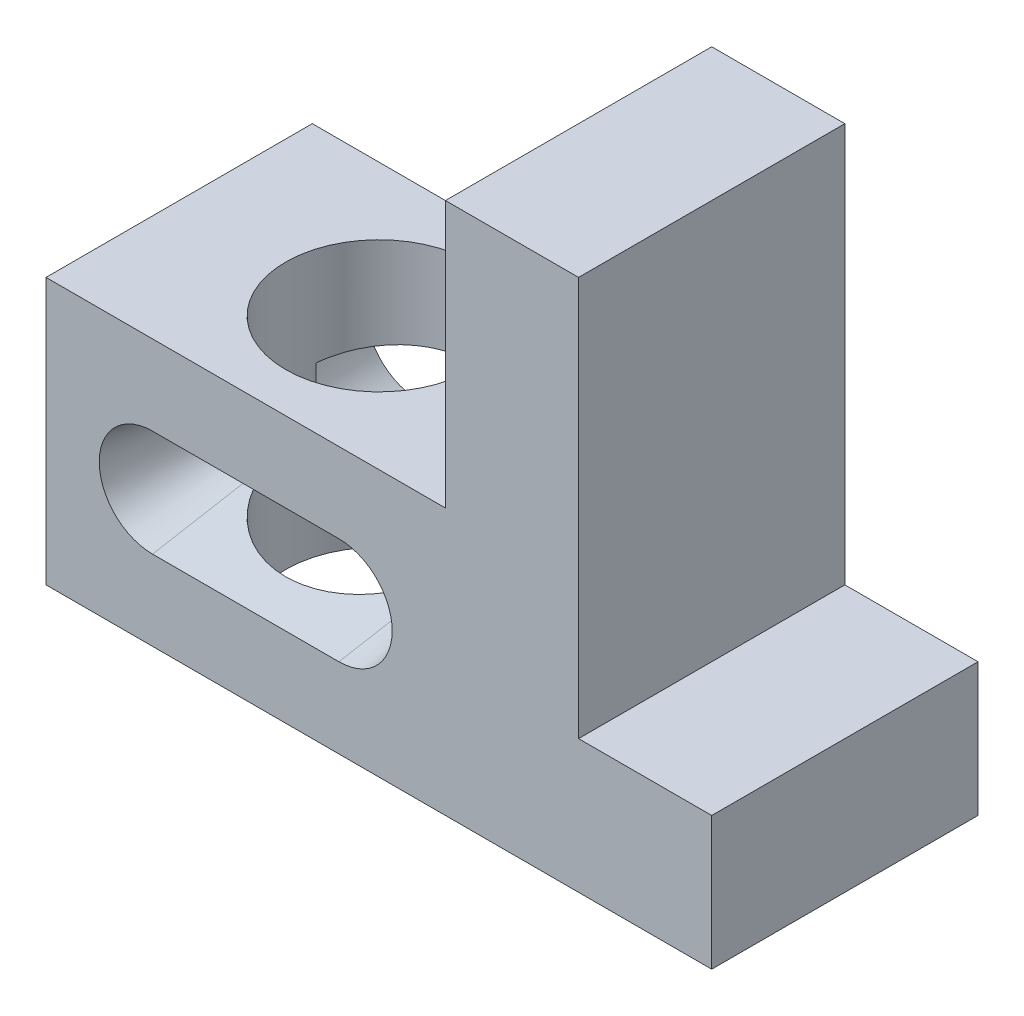
ISO-10303-21;
HEADER;
FILE_DESCRIPTION(('STEP AP214'),'2;1');
FILE_NAME('part.step','',(''),(''),'','','');
FILE_SCHEMA(('AUTOMOTIVE_DESIGN { 1 0 10303 214 1 1 1 1 }'));
ENDSEC;
DATA;
#1=APPLICATION_CONTEXT('core data for automotive mechanical design processes');
#2=APPLICATION_PROTOCOL_DEFINITION('international standard','automotive_design',2000,#1);
#3=PRODUCT_CONTEXT('',#1,'mechanical');
#4=PRODUCT('Part','Part','',(#3));
#5=PRODUCT_RELATED_PRODUCT_CATEGORY('part','',(#4));
#6=PRODUCT_DEFINITION_FORMATION('','',#4);
#7=PRODUCT_DEFINITION_CONTEXT('part definition',#1,'design');
#8=PRODUCT_DEFINITION('design','',#6,#7);
#9=PRODUCT_DEFINITION_SHAPE('','',#8);
#10=(LENGTH_UNIT() NAMED_UNIT(*) SI_UNIT(.MILLI.,.METRE.));
#11=(NAMED_UNIT(*) PLANE_ANGLE_UNIT() SI_UNIT($,.RADIAN.));
#12=(NAMED_UNIT(*) SI_UNIT($,.STERADIAN.) SOLID_ANGLE_UNIT());
#13=UNCERTAINTY_MEASURE_WITH_UNIT(LENGTH_MEASURE(1.E-05),#10,'distance_accuracy_value','');
#14=(GEOMETRIC_REPRESENTATION_CONTEXT(3) GLOBAL_UNCERTAINTY_ASSIGNED_CONTEXT((#13)) GLOBAL_UNIT_ASSIGNED_CONTEXT((#10,
#11,#12)) REPRESENTATION_CONTEXT('',''));
#15=CARTESIAN_POINT('',(0.,0.,0.));
#16=DIRECTION('',(0.,0.,1.));
#17=DIRECTION('',(1.,0.,0.));
#18=AXIS2_PLACEMENT_3D('',#15,#16,#17);
#19=CARTESIAN_POINT('',(20.,25.,30.));
#20=DIRECTION('',(0.,0.,1.));
#21=DIRECTION('',(1.,0.,0.));
#22=AXIS2_PLACEMENT_3D('',#19,#20,#21);
#23=PLANE('',#22);
#24=DIRECTION('',(0.,1.,0.));
#25=VECTOR('',#24,1.);
#26=CARTESIAN_POINT('',(54.2705098312484,0.,30.));
#27=LINE('',#26,#25);
#28=CARTESIAN_POINT('',(54.2705098312484,18.5265396141693,30.));
#29=VERTEX_POINT('',#28);
#30=CARTESIAN_POINT('',(54.2705098312484,31.4734603858307,30.));
#31=VERTEX_POINT('',#30);
#32=EDGE_CURVE('E379',#29,#31,#27,.T.);
#33=ORIENTED_EDGE('',*,*,#32,.F.);
#34=DIRECTION('',(1.,0.,0.));
#35=VECTOR('',#34,1.);
#36=CARTESIAN_POINT('',(20.,18.5265396141693,30.));
#37=LINE('',#36,#35);
#38=CARTESIAN_POINT('',(55.,18.5265396141693,30.));
#39=VERTEX_POINT('',#38);
#40=EDGE_CURVE('E219',#29,#39,#37,.T.);
#41=ORIENTED_EDGE('',*,*,#40,.T.);
#42=CARTESIAN_POINT('',(55.,25.,30.));
#43=DIRECTION('',(0.,0.,1.));
#44=DIRECTION('',(1.,0.,0.));
#45=AXIS2_PLACEMENT_3D('',#42,#43,#44);
#46=CIRCLE('',#45,6.4734603858307);
#47=CARTESIAN_POINT('',(55.,31.4734603858307,30.));
#48=VERTEX_POINT('',#47);
#49=EDGE_CURVE('E223',#39,#48,#46,.T.);
#50=ORIENTED_EDGE('',*,*,#49,.T.);
#51=DIRECTION('',(-1.,0.,0.));
#52=VECTOR('',#51,1.);
#53=CARTESIAN_POINT('',(20.,31.4734603858307,30.));
#54=LINE('',#53,#52);
#55=EDGE_CURVE('E214',#48,#31,#54,.T.);
#56=ORIENTED_EDGE('',*,*,#55,.T.);
#57=EDGE_LOOP('',(#33,#41,#50,#56));
#58=FACE_BOUND('',#57,.T.);
#59=ADVANCED_FACE('F30',(#58),#23,.T.);
#60=CARTESIAN_POINT('',(55.,25.,20.));
#61=DIRECTION('',(0.,0.,-1.));
#62=DIRECTION('',(-1.,0.,0.));
#63=AXIS2_PLACEMENT_3D('',#60,#61,#62);
#64=PLANE('',#63);
#65=DIRECTION('',(0.,1.,0.));
#66=VECTOR('',#65,1.);
#67=CARTESIAN_POINT('',(20.7294901687516,0.,20.));
#68=LINE('',#67,#66);
#69=CARTESIAN_POINT('',(20.7294901687516,18.5265396141693,20.));
#70=VERTEX_POINT('',#69);
#71=CARTESIAN_POINT('',(20.7294901687516,31.4734603858307,20.));
#72=VERTEX_POINT('',#71);
#73=EDGE_CURVE('E11',#70,#72,#68,.T.);
#74=ORIENTED_EDGE('',*,*,#73,.F.);
#75=DIRECTION('',(-1.,0.,0.));
#76=VECTOR('',#75,1.);
#77=CARTESIAN_POINT('',(55.,18.5265396141693,20.));
#78=LINE('',#77,#76);
#79=CARTESIAN_POINT('',(20.,18.5265396141693,20.));
#80=VERTEX_POINT('',#79);
#81=EDGE_CURVE('E180',#70,#80,#78,.T.);
#82=ORIENTED_EDGE('',*,*,#81,.T.);
#83=CARTESIAN_POINT('',(20.,25.,20.));
#84=DIRECTION('',(0.,0.,-1.));
#85=DIRECTION('',(-1.,0.,0.));
#86=AXIS2_PLACEMENT_3D('',#83,#84,#85);
#87=CIRCLE('',#86,6.47346038583069);
#88=CARTESIAN_POINT('',(20.,31.4734603858307,20.));
#89=VERTEX_POINT('',#88);
#90=EDGE_CURVE('E186',#80,#89,#87,.T.);
#91=ORIENTED_EDGE('',*,*,#90,.T.);
#92=DIRECTION('',(1.,0.,0.));
#93=VECTOR('',#92,1.);
#94=CARTESIAN_POINT('',(55.,31.4734603858307,20.));
#95=LINE('',#94,#93);
#96=EDGE_CURVE('E400',#89,#72,#95,.T.);
#97=ORIENTED_EDGE('',*,*,#96,.T.);
#98=EDGE_LOOP('',(#74,#82,#91,#97));
#99=FACE_BOUND('',#98,.T.);
#100=ADVANCED_FACE('F334',(#99),#64,.T.);
#101=CARTESIAN_POINT('',(125.,0.,50.));
#102=DIRECTION('',(0.,1.,0.));
#103=DIRECTION('',(-1.,0.,0.));
#104=AXIS2_PLACEMENT_3D('',#101,#102,#103);
#105=PLANE('',#104);
#106=CARTESIAN_POINT('',(37.5,0.,25.));
#107=DIRECTION('',(0.,1.,0.));
#108=DIRECTION('',(0.,0.,1.));
#109=AXIS2_PLACEMENT_3D('',#106,#107,#108);
#110=CIRCLE('',#109,17.5);
#111=CARTESIAN_POINT('',(37.5,0.,42.5));
#112=VERTEX_POINT('',#111);
#113=EDGE_CURVE('E181',#112,#112,#110,.T.);
#114=ORIENTED_EDGE('',*,*,#113,.T.);
#115=EDGE_LOOP('',(#114));
#116=FACE_BOUND('',#115,.T.);
#117=DIRECTION('',(1.,0.,0.));
#118=VECTOR('',#117,1.);
#119=CARTESIAN_POINT('',(125.,0.,0.));
#120=LINE('',#119,#118);
#121=CARTESIAN_POINT('',(0.,0.,0.));
#122=VERTEX_POINT('',#121);
#123=CARTESIAN_POINT('',(125.,0.,0.));
#124=VERTEX_POINT('',#123);
#125=EDGE_CURVE('E208',#122,#124,#120,.T.);
#126=ORIENTED_EDGE('',*,*,#125,.T.);
#127=DIRECTION('',(0.,0.,-1.));
#128=VECTOR('',#127,1.);
#129=CARTESIAN_POINT('',(125.,0.,50.));
#130=LINE('',#129,#128);
#131=CARTESIAN_POINT('',(125.,0.,50.));
#132=VERTEX_POINT('',#131);
#133=EDGE_CURVE('E171',#132,#124,#130,.T.);
#134=ORIENTED_EDGE('',*,*,#133,.F.);
#135=DIRECTION('',(1.,0.,0.));
#136=VECTOR('',#135,1.);
#137=CARTESIAN_POINT('',(125.,0.,50.));
#138=LINE('',#137,#136);
#139=CARTESIAN_POINT('',(0.,0.,50.));
#140=VERTEX_POINT('',#139);
#141=EDGE_CURVE('E229',#140,#132,#138,.T.);
#142=ORIENTED_EDGE('',*,*,#141,.F.);
#143=DIRECTION('',(0.,0.,-1.));
#144=VECTOR('',#143,1.);
#145=CARTESIAN_POINT('',(0.,0.,50.));
#146=LINE('',#145,#144);
#147=EDGE_CURVE('E247',#140,#122,#146,.T.);
#148=ORIENTED_EDGE('',*,*,#147,.T.);
#149=EDGE_LOOP('',(#126,#134,#142,#148));
#150=FACE_BOUND('',#149,.T.);
#151=ADVANCED_FACE('F32',(#116,#150),#105,.F.);
#152=CARTESIAN_POINT('',(125.,25.,50.));
#153=DIRECTION('',(-1.,0.,0.));
#154=DIRECTION('',(0.,-1.,0.));
#155=AXIS2_PLACEMENT_3D('',#152,#153,#154);
#156=PLANE('',#155);
#157=DIRECTION('',(0.,1.,0.));
#158=VECTOR('',#157,1.);
#159=CARTESIAN_POINT('',(125.,25.,0.));
#160=LINE('',#159,#158);
#161=CARTESIAN_POINT('',(125.,25.,0.));
#162=VERTEX_POINT('',#161);
#163=EDGE_CURVE('E250',#124,#162,#160,.T.);
#164=ORIENTED_EDGE('',*,*,#163,.T.);
#165=DIRECTION('',(0.,0.,-1.));
#166=VECTOR('',#165,1.);
#167=CARTESIAN_POINT('',(125.,25.,50.));
#168=LINE('',#167,#166);
#169=CARTESIAN_POINT('',(125.,25.,50.));
#170=VERTEX_POINT('',#169);
#171=EDGE_CURVE('E280',#170,#162,#168,.T.);
#172=ORIENTED_EDGE('',*,*,#171,.F.);
#173=DIRECTION('',(0.,1.,0.));
#174=VECTOR('',#173,1.);
#175=CARTESIAN_POINT('',(125.,25.,50.));
#176=LINE('',#175,#174);
#177=EDGE_CURVE('E232',#132,#170,#176,.T.);
#178=ORIENTED_EDGE('',*,*,#177,.F.);
#179=ORIENTED_EDGE('',*,*,#133,.T.);
#180=EDGE_LOOP('',(#164,#172,#178,#179));
#181=FACE_BOUND('',#180,.T.);
#182=ADVANCED_FACE('F286',(#181),#156,.F.);
#183=CARTESIAN_POINT('',(100.,25.,50.));
#184=DIRECTION('',(0.,-1.,0.));
#185=DIRECTION('',(1.,0.,0.));
#186=AXIS2_PLACEMENT_3D('',#183,#184,#185);
#187=PLANE('',#186);
#188=DIRECTION('',(-1.,0.,0.));
#189=VECTOR('',#188,1.);
#190=CARTESIAN_POINT('',(100.,25.,0.));
#191=LINE('',#190,#189);
#192=CARTESIAN_POINT('',(100.,25.,0.));
#193=VERTEX_POINT('',#192);
#194=EDGE_CURVE('E252',#162,#193,#191,.T.);
#195=ORIENTED_EDGE('',*,*,#194,.T.);
#196=DIRECTION('',(0.,0.,-1.));
#197=VECTOR('',#196,1.);
#198=CARTESIAN_POINT('',(100.,25.,50.));
#199=LINE('',#198,#197);
#200=CARTESIAN_POINT('',(100.,25.,50.));
#201=VERTEX_POINT('',#200);
#202=EDGE_CURVE('E277',#201,#193,#199,.T.);
#203=ORIENTED_EDGE('',*,*,#202,.F.);
#204=DIRECTION('',(-1.,0.,0.));
#205=VECTOR('',#204,1.);
#206=CARTESIAN_POINT('',(100.,25.,50.));
#207=LINE('',#206,#205);
#208=EDGE_CURVE('E235',#170,#201,#207,.T.);
#209=ORIENTED_EDGE('',*,*,#208,.F.);
#210=ORIENTED_EDGE('',*,*,#171,.T.);
#211=EDGE_LOOP('',(#195,#203,#209,#210));
#212=FACE_BOUND('',#211,.T.);
#213=ADVANCED_FACE('F301',(#212),#187,.F.);
#214=CARTESIAN_POINT('',(100.,100.,50.));
#215=DIRECTION('',(-1.,0.,0.));
#216=DIRECTION('',(0.,-1.,0.));
#217=AXIS2_PLACEMENT_3D('',#214,#215,#216);
#218=PLANE('',#217);
#219=DIRECTION('',(0.,1.,0.));
#220=VECTOR('',#219,1.);
#221=CARTESIAN_POINT('',(100.,100.,0.));
#222=LINE('',#221,#220);
#223=CARTESIAN_POINT('',(100.,100.,0.));
#224=VERTEX_POINT('',#223);
#225=EDGE_CURVE('E254',#193,#224,#222,.T.);
#226=ORIENTED_EDGE('',*,*,#225,.T.);
#227=DIRECTION('',(0.,0.,-1.));
#228=VECTOR('',#227,1.);
#229=CARTESIAN_POINT('',(100.,100.,50.));
#230=LINE('',#229,#228);
#231=CARTESIAN_POINT('',(100.,100.,50.));
#232=VERTEX_POINT('',#231);
#233=EDGE_CURVE('E274',#232,#224,#230,.T.);
#234=ORIENTED_EDGE('',*,*,#233,.F.);
#235=DIRECTION('',(0.,1.,0.));
#236=VECTOR('',#235,1.);
#237=CARTESIAN_POINT('',(100.,100.,50.));
#238=LINE('',#237,#236);
#239=EDGE_CURVE('E237',#201,#232,#238,.T.);
#240=ORIENTED_EDGE('',*,*,#239,.F.);
#241=ORIENTED_EDGE('',*,*,#202,.T.);
#242=EDGE_LOOP('',(#226,#234,#240,#241));
#243=FACE_BOUND('',#242,.T.);
#244=ADVANCED_FACE('F305',(#243),#218,.F.);
#245=CARTESIAN_POINT('',(75.,100.,50.));
#246=DIRECTION('',(0.,-1.,0.));
#247=DIRECTION('',(0.,0.,-1.));
#248=AXIS2_PLACEMENT_3D('',#245,#246,#247);
#249=PLANE('',#248);
#250=DIRECTION('',(-1.,0.,0.));
#251=VECTOR('',#250,1.);
#252=CARTESIAN_POINT('',(75.,100.,0.));
#253=LINE('',#252,#251);
#254=CARTESIAN_POINT('',(75.,100.,0.));
#255=VERTEX_POINT('',#254);
#256=EDGE_CURVE('E256',#224,#255,#253,.T.);
#257=ORIENTED_EDGE('',*,*,#256,.T.);
#258=DIRECTION('',(0.,0.,-1.));
#259=VECTOR('',#258,1.);
#260=CARTESIAN_POINT('',(75.,100.,50.));
#261=LINE('',#260,#259);
#262=CARTESIAN_POINT('',(75.,100.,50.));
#263=VERTEX_POINT('',#262);
#264=EDGE_CURVE('E271',#263,#255,#261,.T.);
#265=ORIENTED_EDGE('',*,*,#264,.F.);
#266=DIRECTION('',(-1.,0.,0.));
#267=VECTOR('',#266,1.);
#268=CARTESIAN_POINT('',(75.,100.,50.));
#269=LINE('',#268,#267);
#270=EDGE_CURVE('E239',#232,#263,#269,.T.);
#271=ORIENTED_EDGE('',*,*,#270,.F.);
#272=ORIENTED_EDGE('',*,*,#233,.T.);
#273=EDGE_LOOP('',(#257,#265,#271,#272));
#274=FACE_BOUND('',#273,.T.);
#275=ADVANCED_FACE('F324',(#274),#249,.F.);
#276=CARTESIAN_POINT('',(75.,50.,50.));
#277=DIRECTION('',(1.,0.,0.));
#278=DIRECTION('',(0.,0.,-1.));
#279=AXIS2_PLACEMENT_3D('',#276,#277,#278);
#280=PLANE('',#279);
#281=DIRECTION('',(0.,-1.,0.));
#282=VECTOR('',#281,1.);
#283=CARTESIAN_POINT('',(75.,50.,0.));
#284=LINE('',#283,#282);
#285=CARTESIAN_POINT('',(75.,50.,0.));
#286=VERTEX_POINT('',#285);
#287=EDGE_CURVE('E258',#255,#286,#284,.T.);
#288=ORIENTED_EDGE('',*,*,#287,.T.);
#289=DIRECTION('',(0.,0.,-1.));
#290=VECTOR('',#289,1.);
#291=CARTESIAN_POINT('',(75.,50.,50.));
#292=LINE('',#291,#290);
#293=CARTESIAN_POINT('',(75.,50.,50.));
#294=VERTEX_POINT('',#293);
#295=EDGE_CURVE('E268',#294,#286,#292,.T.);
#296=ORIENTED_EDGE('',*,*,#295,.F.);
#297=DIRECTION('',(0.,-1.,0.));
#298=VECTOR('',#297,1.);
#299=CARTESIAN_POINT('',(75.,50.,50.));
#300=LINE('',#299,#298);
#301=EDGE_CURVE('E241',#263,#294,#300,.T.);
#302=ORIENTED_EDGE('',*,*,#301,.F.);
#303=ORIENTED_EDGE('',*,*,#264,.T.);
#304=EDGE_LOOP('',(#288,#296,#302,#303));
#305=FACE_BOUND('',#304,.T.);
#306=ADVANCED_FACE('F321',(#305),#280,.F.);
#307=CARTESIAN_POINT('',(0.,50.,50.));
#308=DIRECTION('',(0.,-1.,0.));
#309=DIRECTION('',(0.,0.,-1.));
#310=AXIS2_PLACEMENT_3D('',#307,#308,#309);
#311=PLANE('',#310);
#312=CARTESIAN_POINT('',(37.5,50.,25.));
#313=DIRECTION('',(0.,1.,0.));
#314=DIRECTION('',(0.,0.,1.));
#315=AXIS2_PLACEMENT_3D('',#312,#313,#314);
#316=CIRCLE('',#315,17.5);
#317=CARTESIAN_POINT('',(37.5,50.,42.5));
#318=VERTEX_POINT('',#317);
#319=EDGE_CURVE('E416',#318,#318,#316,.T.);
#320=ORIENTED_EDGE('',*,*,#319,.F.);
#321=EDGE_LOOP('',(#320));
#322=FACE_BOUND('',#321,.T.);
#323=DIRECTION('',(-1.,0.,0.));
#324=VECTOR('',#323,1.);
#325=CARTESIAN_POINT('',(0.,50.,0.));
#326=LINE('',#325,#324);
#327=CARTESIAN_POINT('',(0.,50.,0.));
#328=VERTEX_POINT('',#327);
#329=EDGE_CURVE('E260',#286,#328,#326,.T.);
#330=ORIENTED_EDGE('',*,*,#329,.T.);
#331=DIRECTION('',(0.,0.,-1.));
#332=VECTOR('',#331,1.);
#333=CARTESIAN_POINT('',(0.,50.,50.));
#334=LINE('',#333,#332);
#335=CARTESIAN_POINT('',(0.,50.,50.));
#336=VERTEX_POINT('',#335);
#337=EDGE_CURVE('E265',#336,#328,#334,.T.);
#338=ORIENTED_EDGE('',*,*,#337,.F.);
#339=DIRECTION('',(-1.,0.,0.));
#340=VECTOR('',#339,1.);
#341=CARTESIAN_POINT('',(0.,50.,50.));
#342=LINE('',#341,#340);
#343=EDGE_CURVE('E243',#294,#336,#342,.T.);
#344=ORIENTED_EDGE('',*,*,#343,.F.);
#345=ORIENTED_EDGE('',*,*,#295,.T.);
#346=EDGE_LOOP('',(#330,#338,#344,#345));
#347=FACE_BOUND('',#346,.T.);
#348=ADVANCED_FACE('F317',(#322,#347),#311,.F.);
#349=CARTESIAN_POINT('',(0.,0.,50.));
#350=DIRECTION('',(1.,0.,0.));
#351=DIRECTION('',(0.,0.,-1.));
#352=AXIS2_PLACEMENT_3D('',#349,#350,#351);
#353=PLANE('',#352);
#354=DIRECTION('',(0.,-1.,0.));
#355=VECTOR('',#354,1.);
#356=CARTESIAN_POINT('',(0.,0.,0.));
#357=LINE('',#356,#355);
#358=EDGE_CURVE('E233',#328,#122,#357,.T.);
#359=ORIENTED_EDGE('',*,*,#358,.T.);
#360=ORIENTED_EDGE('',*,*,#147,.F.);
#361=DIRECTION('',(0.,-1.,0.));
#362=VECTOR('',#361,1.);
#363=CARTESIAN_POINT('',(0.,0.,50.));
#364=LINE('',#363,#362);
#365=EDGE_CURVE('E245',#336,#140,#364,.T.);
#366=ORIENTED_EDGE('',*,*,#365,.F.);
#367=ORIENTED_EDGE('',*,*,#337,.T.);
#368=EDGE_LOOP('',(#359,#360,#366,#367));
#369=FACE_BOUND('',#368,.T.);
#370=ADVANCED_FACE('F315',(#369),#353,.F.);
#371=CARTESIAN_POINT('',(0.,0.,50.));
#372=DIRECTION('',(0.,0.,-1.));
#373=DIRECTION('',(-1.,0.,0.));
#374=AXIS2_PLACEMENT_3D('',#371,#372,#373);
#375=PLANE('',#374);
#376=DIRECTION('',(1.,0.,0.));
#377=VECTOR('',#376,1.);
#378=CARTESIAN_POINT('',(20.,15.,50.));
#379=LINE('',#378,#377);
#380=CARTESIAN_POINT('',(20.,15.,50.));
#381=VERTEX_POINT('',#380);
#382=CARTESIAN_POINT('',(55.,15.,50.));
#383=VERTEX_POINT('',#382);
#384=EDGE_CURVE('E195',#381,#383,#379,.T.);
#385=ORIENTED_EDGE('',*,*,#384,.F.);
#386=CARTESIAN_POINT('',(20.,25.,50.));
#387=DIRECTION('',(0.,0.,1.));
#388=DIRECTION('',(1.,0.,0.));
#389=AXIS2_PLACEMENT_3D('',#386,#387,#388);
#390=CIRCLE('',#389,10.);
#391=CARTESIAN_POINT('',(20.,35.,50.));
#392=VERTEX_POINT('',#391);
#393=EDGE_CURVE('E193',#392,#381,#390,.T.);
#394=ORIENTED_EDGE('',*,*,#393,.F.);
#395=DIRECTION('',(-1.,0.,0.));
#396=VECTOR('',#395,1.);
#397=CARTESIAN_POINT('',(20.,35.,50.));
#398=LINE('',#397,#396);
#399=CARTESIAN_POINT('',(55.,35.,50.));
#400=VERTEX_POINT('',#399);
#401=EDGE_CURVE('E202',#400,#392,#398,.T.);
#402=ORIENTED_EDGE('',*,*,#401,.F.);
#403=CARTESIAN_POINT('',(55.,25.,50.));
#404=DIRECTION('',(0.,0.,1.));
#405=DIRECTION('',(1.,0.,0.));
#406=AXIS2_PLACEMENT_3D('',#403,#404,#405);
#407=CIRCLE('',#406,10.);
#408=EDGE_CURVE('E199',#383,#400,#407,.T.);
#409=ORIENTED_EDGE('',*,*,#408,.F.);
#410=EDGE_LOOP('',(#385,#394,#402,#409));
#411=FACE_BOUND('',#410,.T.);
#412=ORIENTED_EDGE('',*,*,#141,.T.);
#413=ORIENTED_EDGE('',*,*,#177,.T.);
#414=ORIENTED_EDGE('',*,*,#208,.T.);
#415=ORIENTED_EDGE('',*,*,#239,.T.);
#416=ORIENTED_EDGE('',*,*,#270,.T.);
#417=ORIENTED_EDGE('',*,*,#301,.T.);
#418=ORIENTED_EDGE('',*,*,#343,.T.);
#419=ORIENTED_EDGE('',*,*,#365,.T.);
#420=EDGE_LOOP('',(#412,#413,#414,#415,#416,#417,#418,#419));
#421=FACE_BOUND('',#420,.T.);
#422=ADVANCED_FACE('F309',(#411,#421),#375,.F.);
#423=CARTESIAN_POINT('',(0.,0.,0.));
#424=DIRECTION('',(0.,0.,-1.));
#425=DIRECTION('',(-1.,0.,0.));
#426=AXIS2_PLACEMENT_3D('',#423,#424,#425);
#427=PLANE('',#426);
#428=CARTESIAN_POINT('',(55.,25.,0.));
#429=DIRECTION('',(0.,0.,-1.));
#430=DIRECTION('',(-1.,0.,0.));
#431=AXIS2_PLACEMENT_3D('',#428,#429,#430);
#432=CIRCLE('',#431,10.);
#433=CARTESIAN_POINT('',(55.,35.,0.));
#434=VERTEX_POINT('',#433);
#435=CARTESIAN_POINT('',(55.,15.,0.));
#436=VERTEX_POINT('',#435);
#437=EDGE_CURVE('E384',#434,#436,#432,.T.);
#438=ORIENTED_EDGE('',*,*,#437,.F.);
#439=DIRECTION('',(1.,0.,0.));
#440=VECTOR('',#439,1.);
#441=CARTESIAN_POINT('',(55.,35.,0.));
#442=LINE('',#441,#440);
#443=CARTESIAN_POINT('',(20.,35.,0.));
#444=VERTEX_POINT('',#443);
#445=EDGE_CURVE('E392',#444,#434,#442,.T.);
#446=ORIENTED_EDGE('',*,*,#445,.F.);
#447=CARTESIAN_POINT('',(20.,25.,0.));
#448=DIRECTION('',(0.,0.,-1.));
#449=DIRECTION('',(-1.,0.,0.));
#450=AXIS2_PLACEMENT_3D('',#447,#448,#449);
#451=CIRCLE('',#450,10.);
#452=CARTESIAN_POINT('',(20.,15.,0.));
#453=VERTEX_POINT('',#452);
#454=EDGE_CURVE('E389',#453,#444,#451,.T.);
#455=ORIENTED_EDGE('',*,*,#454,.F.);
#456=DIRECTION('',(-1.,0.,0.));
#457=VECTOR('',#456,1.);
#458=CARTESIAN_POINT('',(20.,15.,0.));
#459=LINE('',#458,#457);
#460=EDGE_CURVE('E386',#436,#453,#459,.T.);
#461=ORIENTED_EDGE('',*,*,#460,.F.);
#462=EDGE_LOOP('',(#438,#446,#455,#461));
#463=FACE_BOUND('',#462,.T.);
#464=ORIENTED_EDGE('',*,*,#125,.F.);
#465=ORIENTED_EDGE('',*,*,#358,.F.);
#466=ORIENTED_EDGE('',*,*,#329,.F.);
#467=ORIENTED_EDGE('',*,*,#287,.F.);
#468=ORIENTED_EDGE('',*,*,#256,.F.);
#469=ORIENTED_EDGE('',*,*,#225,.F.);
#470=ORIENTED_EDGE('',*,*,#194,.F.);
#471=ORIENTED_EDGE('',*,*,#163,.F.);
#472=EDGE_LOOP('',(#464,#465,#466,#467,#468,#469,#470,#471));
#473=FACE_BOUND('',#472,.T.);
#474=ADVANCED_FACE('F294',(#463,#473),#427,.T.);
#475=CARTESIAN_POINT('',(20.,25.,50.));
#476=DIRECTION('',(0.,0.,1.));
#477=DIRECTION('',(1.,0.,0.));
#478=AXIS2_PLACEMENT_3D('',#475,#476,#477);
#479=CONICAL_SURFACE('',#478,10.,0.174532925199433);
#480=ORIENTED_EDGE('',*,*,#393,.T.);
#481=DIRECTION('',(0.,-0.173648177666931,0.984807753012208));
#482=VECTOR('',#481,1.);
#483=CARTESIAN_POINT('',(20.,15.,50.));
#484=LINE('',#483,#482);
#485=CARTESIAN_POINT('',(20.,18.5265396141693,30.));
#486=VERTEX_POINT('',#485);
#487=EDGE_CURVE('E210',#486,#381,#484,.T.);
#488=ORIENTED_EDGE('',*,*,#487,.F.);
#489=CARTESIAN_POINT('',(20.,25.,30.));
#490=DIRECTION('',(0.,0.,1.));
#491=DIRECTION('',(1.,0.,0.));
#492=AXIS2_PLACEMENT_3D('',#489,#490,#491);
#493=CIRCLE('',#492,6.47346038583069);
#494=CARTESIAN_POINT('',(20.,31.4734603858307,30.));
#495=VERTEX_POINT('',#494);
#496=EDGE_CURVE('E205',#495,#486,#493,.T.);
#497=ORIENTED_EDGE('',*,*,#496,.F.);
#498=DIRECTION('',(0.,0.173648177666931,0.984807753012208));
#499=VECTOR('',#498,1.);
#500=CARTESIAN_POINT('',(20.,35.,50.));
#501=LINE('',#500,#499);
#502=EDGE_CURVE('E206',#495,#392,#501,.T.);
#503=ORIENTED_EDGE('',*,*,#502,.T.);
#504=EDGE_LOOP('',(#480,#488,#497,#503));
#505=FACE_BOUND('',#504,.T.);
#506=ADVANCED_FACE('F374',(#505),#479,.F.);
#507=CARTESIAN_POINT('',(20.,35.,50.));
#508=DIRECTION('',(0.,0.984807753012208,-0.173648177666931));
#509=DIRECTION('',(0.,0.173648177666931,0.984807753012208));
#510=AXIS2_PLACEMENT_3D('',#507,#508,#509);
#511=PLANE('',#510);
#512=CARTESIAN_POINT('',(20.7294901687516,31.4734603858307,30.));
#513=VERTEX_POINT('',#512);
#514=EDGE_CURVE('E222',#513,#495,#54,.T.);
#515=ORIENTED_EDGE('',*,*,#514,.F.);
#516=CARTESIAN_POINT('',(37.5,30.5918254822884,25.));
#517=DIRECTION('',(0.,0.984807753012208,-0.173648177666931));
#518=DIRECTION('',(0.,0.173648177666931,0.984807753012208));
#519=AXIS2_PLACEMENT_3D('',#516,#517,#518);
#520=ELLIPSE('',#519,17.7699657080005,17.5);
#521=EDGE_CURVE('E45',#513,#31,#520,.T.);
#522=ORIENTED_EDGE('',*,*,#521,.T.);
#523=ORIENTED_EDGE('',*,*,#55,.F.);
#524=DIRECTION('',(0.,0.173648177666931,0.984807753012208));
#525=VECTOR('',#524,1.);
#526=CARTESIAN_POINT('',(55.,35.,50.));
#527=LINE('',#526,#525);
#528=EDGE_CURVE('E209',#48,#400,#527,.T.);
#529=ORIENTED_EDGE('',*,*,#528,.T.);
#530=ORIENTED_EDGE('',*,*,#401,.T.);
#531=ORIENTED_EDGE('',*,*,#502,.F.);
#532=EDGE_LOOP('',(#515,#522,#523,#529,#530,#531));
#533=FACE_BOUND('',#532,.T.);
#534=ADVANCED_FACE('F368',(#533),#511,.F.);
#535=CARTESIAN_POINT('',(55.,25.,50.));
#536=DIRECTION('',(0.,0.,1.));
#537=DIRECTION('',(1.,0.,0.));
#538=AXIS2_PLACEMENT_3D('',#535,#536,#537);
#539=CONICAL_SURFACE('',#538,10.,0.174532925199433);
#540=ORIENTED_EDGE('',*,*,#408,.T.);
#541=ORIENTED_EDGE('',*,*,#528,.F.);
#542=ORIENTED_EDGE('',*,*,#49,.F.);
#543=DIRECTION('',(0.,-0.173648177666931,0.984807753012208));
#544=VECTOR('',#543,1.);
#545=CARTESIAN_POINT('',(55.,15.,50.));
#546=LINE('',#545,#544);
#547=EDGE_CURVE('E213',#39,#383,#546,.T.);
#548=ORIENTED_EDGE('',*,*,#547,.T.);
#549=EDGE_LOOP('',(#540,#541,#542,#548));
#550=FACE_BOUND('',#549,.T.);
#551=ADVANCED_FACE('F357',(#550),#539,.F.);
#552=CARTESIAN_POINT('',(20.,15.,50.));
#553=DIRECTION('',(0.,-0.984807753012208,-0.173648177666931));
#554=DIRECTION('',(0.,0.173648177666931,-0.984807753012208));
#555=AXIS2_PLACEMENT_3D('',#552,#553,#554);
#556=PLANE('',#555);
#557=ORIENTED_EDGE('',*,*,#40,.F.);
#558=CARTESIAN_POINT('',(37.5,19.4081745177116,25.));
#559=DIRECTION('',(0.,-0.984807753012208,-0.173648177666931));
#560=DIRECTION('',(0.,0.173648177666931,-0.984807753012208));
#561=AXIS2_PLACEMENT_3D('',#558,#559,#560);
#562=ELLIPSE('',#561,17.7699657080005,17.5);
#563=CARTESIAN_POINT('',(20.7294901687516,18.5265396141693,30.));
#564=VERTEX_POINT('',#563);
#565=EDGE_CURVE('E365',#29,#564,#562,.T.);
#566=ORIENTED_EDGE('',*,*,#565,.T.);
#567=EDGE_CURVE('E226',#486,#564,#37,.T.);
#568=ORIENTED_EDGE('',*,*,#567,.F.);
#569=ORIENTED_EDGE('',*,*,#487,.T.);
#570=ORIENTED_EDGE('',*,*,#384,.T.);
#571=ORIENTED_EDGE('',*,*,#547,.F.);
#572=EDGE_LOOP('',(#557,#566,#568,#569,#570,#571));
#573=FACE_BOUND('',#572,.T.);
#574=ADVANCED_FACE('F348',(#573),#556,.F.);
#575=DIRECTION('',(0.,1.,0.));
#576=VECTOR('',#575,1.);
#577=CARTESIAN_POINT('',(20.7294901687516,0.,30.));
#578=LINE('',#577,#576);
#579=EDGE_CURVE('E360',#513,#564,#578,.F.);
#580=ORIENTED_EDGE('',*,*,#579,.F.);
#581=ORIENTED_EDGE('',*,*,#514,.T.);
#582=ORIENTED_EDGE('',*,*,#496,.T.);
#583=ORIENTED_EDGE('',*,*,#567,.T.);
#584=EDGE_LOOP('',(#580,#581,#582,#583));
#585=FACE_BOUND('',#584,.T.);
#586=ADVANCED_FACE('F337',(#585),#23,.T.);
#587=CARTESIAN_POINT('',(55.,25.,0.));
#588=DIRECTION('',(0.,0.,-1.));
#589=DIRECTION('',(-1.,0.,0.));
#590=AXIS2_PLACEMENT_3D('',#587,#588,#589);
#591=CONICAL_SURFACE('',#590,10.,0.174532925199433);
#592=ORIENTED_EDGE('',*,*,#437,.T.);
#593=DIRECTION('',(0.,-0.173648177666931,-0.984807753012208));
#594=VECTOR('',#593,1.);
#595=CARTESIAN_POINT('',(55.,15.,0.));
#596=LINE('',#595,#594);
#597=CARTESIAN_POINT('',(55.,18.5265396141693,20.));
#598=VERTEX_POINT('',#597);
#599=EDGE_CURVE('E397',#598,#436,#596,.T.);
#600=ORIENTED_EDGE('',*,*,#599,.F.);
#601=CARTESIAN_POINT('',(55.,25.,20.));
#602=DIRECTION('',(0.,0.,-1.));
#603=DIRECTION('',(-1.,0.,0.));
#604=AXIS2_PLACEMENT_3D('',#601,#602,#603);
#605=CIRCLE('',#604,6.4734603858307);
#606=CARTESIAN_POINT('',(55.,31.4734603858307,20.));
#607=VERTEX_POINT('',#606);
#608=EDGE_CURVE('E185',#607,#598,#605,.T.);
#609=ORIENTED_EDGE('',*,*,#608,.F.);
#610=DIRECTION('',(0.,0.173648177666931,-0.984807753012208));
#611=VECTOR('',#610,1.);
#612=CARTESIAN_POINT('',(55.,35.,0.));
#613=LINE('',#612,#611);
#614=EDGE_CURVE('E196',#607,#434,#613,.T.);
#615=ORIENTED_EDGE('',*,*,#614,.T.);
#616=EDGE_LOOP('',(#592,#600,#609,#615));
#617=FACE_BOUND('',#616,.T.);
#618=ADVANCED_FACE('F347',(#617),#591,.F.);
#619=CARTESIAN_POINT('',(55.,35.,0.));
#620=DIRECTION('',(0.,0.984807753012208,0.173648177666931));
#621=DIRECTION('',(0.,-0.173648177666931,0.984807753012208));
#622=AXIS2_PLACEMENT_3D('',#619,#620,#621);
#623=PLANE('',#622);
#624=CARTESIAN_POINT('',(54.2705098312484,31.4734603858307,20.));
#625=VERTEX_POINT('',#624);
#626=EDGE_CURVE('E189',#625,#607,#95,.T.);
#627=ORIENTED_EDGE('',*,*,#626,.F.);
#628=CARTESIAN_POINT('',(37.5,30.5918254822884,25.));
#629=DIRECTION('',(0.,0.984807753012208,0.173648177666931));
#630=DIRECTION('',(0.,0.173648177666931,-0.984807753012208));
#631=AXIS2_PLACEMENT_3D('',#628,#629,#630);
#632=ELLIPSE('',#631,17.7699657080005,17.5);
#633=EDGE_CURVE('E52',#625,#72,#632,.T.);
#634=ORIENTED_EDGE('',*,*,#633,.T.);
#635=ORIENTED_EDGE('',*,*,#96,.F.);
#636=DIRECTION('',(0.,0.173648177666931,-0.984807753012208));
#637=VECTOR('',#636,1.);
#638=CARTESIAN_POINT('',(20.,35.,0.));
#639=LINE('',#638,#637);
#640=EDGE_CURVE('E396',#89,#444,#639,.T.);
#641=ORIENTED_EDGE('',*,*,#640,.T.);
#642=ORIENTED_EDGE('',*,*,#445,.T.);
#643=ORIENTED_EDGE('',*,*,#614,.F.);
#644=EDGE_LOOP('',(#627,#634,#635,#641,#642,#643));
#645=FACE_BOUND('',#644,.T.);
#646=ADVANCED_FACE('F354',(#645),#623,.F.);
#647=CARTESIAN_POINT('',(20.,25.,0.));
#648=DIRECTION('',(0.,0.,-1.));
#649=DIRECTION('',(-1.,0.,0.));
#650=AXIS2_PLACEMENT_3D('',#647,#648,#649);
#651=CONICAL_SURFACE('',#650,10.,0.174532925199433);
#652=ORIENTED_EDGE('',*,*,#454,.T.);
#653=ORIENTED_EDGE('',*,*,#640,.F.);
#654=ORIENTED_EDGE('',*,*,#90,.F.);
#655=DIRECTION('',(0.,-0.173648177666931,-0.984807753012208));
#656=VECTOR('',#655,1.);
#657=CARTESIAN_POINT('',(20.,15.,0.));
#658=LINE('',#657,#656);
#659=EDGE_CURVE('E399',#80,#453,#658,.T.);
#660=ORIENTED_EDGE('',*,*,#659,.T.);
#661=EDGE_LOOP('',(#652,#653,#654,#660));
#662=FACE_BOUND('',#661,.T.);
#663=ADVANCED_FACE('F413',(#662),#651,.F.);
#664=CARTESIAN_POINT('',(20.,15.,0.));
#665=DIRECTION('',(0.,-0.984807753012208,0.173648177666931));
#666=DIRECTION('',(0.,-0.173648177666931,-0.984807753012208));
#667=AXIS2_PLACEMENT_3D('',#664,#665,#666);
#668=PLANE('',#667);
#669=ORIENTED_EDGE('',*,*,#81,.F.);
#670=CARTESIAN_POINT('',(37.5,19.4081745177116,25.));
#671=DIRECTION('',(0.,-0.984807753012208,0.173648177666931));
#672=DIRECTION('',(0.,0.173648177666931,0.984807753012208));
#673=AXIS2_PLACEMENT_3D('',#670,#671,#672);
#674=ELLIPSE('',#673,17.7699657080005,17.5);
#675=CARTESIAN_POINT('',(54.2705098312484,18.5265396141693,20.));
#676=VERTEX_POINT('',#675);
#677=EDGE_CURVE('E166',#70,#676,#674,.T.);
#678=ORIENTED_EDGE('',*,*,#677,.T.);
#679=EDGE_CURVE('E177',#598,#676,#78,.T.);
#680=ORIENTED_EDGE('',*,*,#679,.F.);
#681=ORIENTED_EDGE('',*,*,#599,.T.);
#682=ORIENTED_EDGE('',*,*,#460,.T.);
#683=ORIENTED_EDGE('',*,*,#659,.F.);
#684=EDGE_LOOP('',(#669,#678,#680,#681,#682,#683));
#685=FACE_BOUND('',#684,.T.);
#686=ADVANCED_FACE('F175',(#685),#668,.F.);
#687=DIRECTION('',(0.,1.,0.));
#688=VECTOR('',#687,1.);
#689=CARTESIAN_POINT('',(54.2705098312484,0.,20.));
#690=LINE('',#689,#688);
#691=EDGE_CURVE('E38',#625,#676,#690,.F.);
#692=ORIENTED_EDGE('',*,*,#691,.F.);
#693=ORIENTED_EDGE('',*,*,#626,.T.);
#694=ORIENTED_EDGE('',*,*,#608,.T.);
#695=ORIENTED_EDGE('',*,*,#679,.T.);
#696=EDGE_LOOP('',(#692,#693,#694,#695));
#697=FACE_BOUND('',#696,.T.);
#698=ADVANCED_FACE('F183',(#697),#64,.T.);
#699=CARTESIAN_POINT('',(37.5,0.,25.));
#700=DIRECTION('',(0.,1.,0.));
#701=DIRECTION('',(0.,0.,1.));
#702=AXIS2_PLACEMENT_3D('',#699,#700,#701);
#703=CYLINDRICAL_SURFACE('',#702,17.5);
#704=ORIENTED_EDGE('',*,*,#32,.T.);
#705=ORIENTED_EDGE('',*,*,#521,.F.);
#706=ORIENTED_EDGE('',*,*,#579,.T.);
#707=ORIENTED_EDGE('',*,*,#565,.F.);
#708=EDGE_LOOP('',(#704,#705,#706,#707));
#709=FACE_BOUND('',#708,.T.);
#710=ORIENTED_EDGE('',*,*,#73,.T.);
#711=ORIENTED_EDGE('',*,*,#633,.F.);
#712=ORIENTED_EDGE('',*,*,#691,.T.);
#713=ORIENTED_EDGE('',*,*,#677,.F.);
#714=EDGE_LOOP('',(#710,#711,#712,#713));
#715=FACE_BOUND('',#714,.T.);
#716=ORIENTED_EDGE('',*,*,#113,.F.);
#717=EDGE_LOOP('',(#716));
#718=FACE_BOUND('',#717,.T.);
#719=ORIENTED_EDGE('',*,*,#319,.T.);
#720=EDGE_LOOP('',(#719));
#721=FACE_BOUND('',#720,.T.);
#722=ADVANCED_FACE('F164',(#709,#715,#718,#721),#703,.F.);
#723=CLOSED_SHELL('',(#59,#100,#151,#182,#213,#244,#275,#306,#348,#370,#422,#474,#506,#534,#551,
#574,#586,#618,#646,#663,#686,#698,#722));
#724=MANIFOLD_SOLID_BREP('B2',#723);
#725=ADVANCED_BREP_SHAPE_REPRESENTATION('',(#18,#724),#14);
#726=SHAPE_DEFINITION_REPRESENTATION(#9,#725);
ENDSEC;
END-ISO-10303-21;
